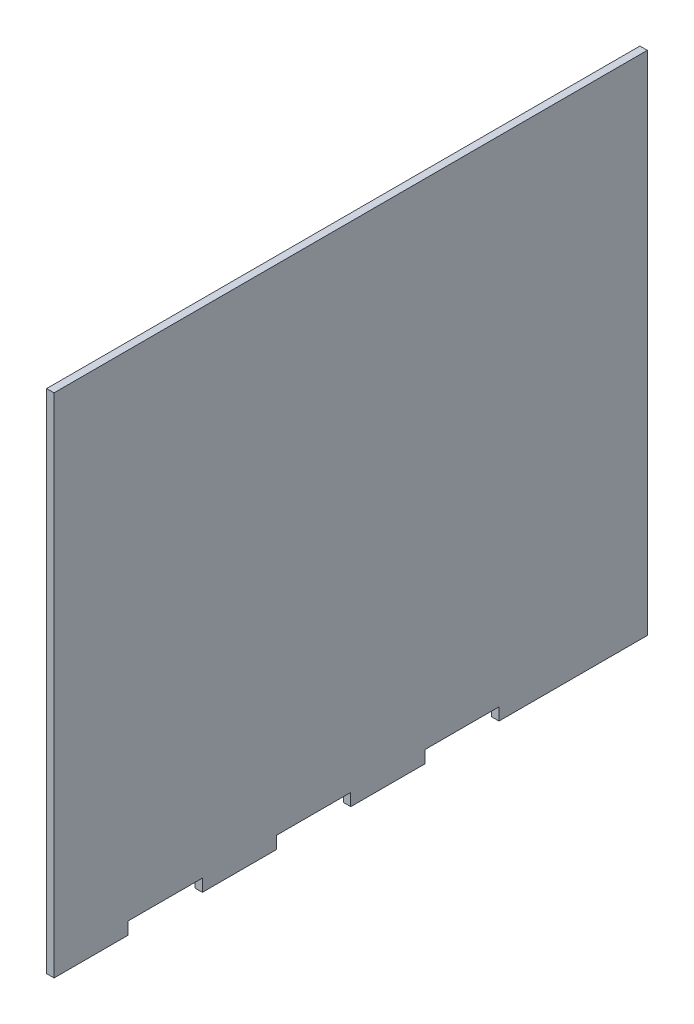
ISO-10303-21;
HEADER;
FILE_DESCRIPTION(('STEP AP214'),'2;1');
FILE_NAME('part.step','',(''),(''),'','','');
FILE_SCHEMA(('AUTOMOTIVE_DESIGN { 1 0 10303 214 1 1 1 1 }'));
ENDSEC;
DATA;
#1=APPLICATION_CONTEXT('core data for automotive mechanical design processes');
#2=APPLICATION_PROTOCOL_DEFINITION('international standard','automotive_design',2000,#1);
#3=PRODUCT_CONTEXT('',#1,'mechanical');
#4=PRODUCT('Part','Part','',(#3));
#5=PRODUCT_RELATED_PRODUCT_CATEGORY('part','',(#4));
#6=PRODUCT_DEFINITION_FORMATION('','',#4);
#7=PRODUCT_DEFINITION_CONTEXT('part definition',#1,'design');
#8=PRODUCT_DEFINITION('design','',#6,#7);
#9=PRODUCT_DEFINITION_SHAPE('','',#8);
#10=(LENGTH_UNIT() NAMED_UNIT(*) SI_UNIT(.MILLI.,.METRE.));
#11=(NAMED_UNIT(*) PLANE_ANGLE_UNIT() SI_UNIT($,.RADIAN.));
#12=(NAMED_UNIT(*) SI_UNIT($,.STERADIAN.) SOLID_ANGLE_UNIT());
#13=UNCERTAINTY_MEASURE_WITH_UNIT(LENGTH_MEASURE(1.E-05),#10,'distance_accuracy_value','');
#14=(GEOMETRIC_REPRESENTATION_CONTEXT(3) GLOBAL_UNCERTAINTY_ASSIGNED_CONTEXT((#13)) GLOBAL_UNIT_ASSIGNED_CONTEXT((#10,
#11,#12)) REPRESENTATION_CONTEXT('',''));
#15=CARTESIAN_POINT('',(0.,0.,0.));
#16=DIRECTION('',(0.,0.,1.));
#17=DIRECTION('',(1.,0.,0.));
#18=AXIS2_PLACEMENT_3D('',#15,#16,#17);
#19=CARTESIAN_POINT('',(3.,-102.5,120.));
#20=DIRECTION('',(0.,1.,0.));
#21=DIRECTION('',(0.,0.,1.));
#22=AXIS2_PLACEMENT_3D('',#19,#20,#21);
#23=PLANE('',#22);
#24=DIRECTION('',(0.,0.,-1.));
#25=VECTOR('',#24,1.);
#26=CARTESIAN_POINT('',(0.,-102.5,120.));
#27=LINE('',#26,#25);
#28=CARTESIAN_POINT('',(0.,-102.5,120.));
#29=VERTEX_POINT('',#28);
#30=CARTESIAN_POINT('',(0.,-102.5,90.));
#31=VERTEX_POINT('',#30);
#32=EDGE_CURVE('E173',#29,#31,#27,.T.);
#33=ORIENTED_EDGE('',*,*,#32,.T.);
#34=DIRECTION('',(1.,0.,0.));
#35=VECTOR('',#34,1.);
#36=CARTESIAN_POINT('',(0.,-102.5,90.));
#37=LINE('',#36,#35);
#38=CARTESIAN_POINT('',(3.,-102.5,90.));
#39=VERTEX_POINT('',#38);
#40=EDGE_CURVE('E205',#31,#39,#37,.T.);
#41=ORIENTED_EDGE('',*,*,#40,.T.);
#42=DIRECTION('',(0.,0.,-1.));
#43=VECTOR('',#42,1.);
#44=CARTESIAN_POINT('',(3.,-102.5,120.));
#45=LINE('',#44,#43);
#46=CARTESIAN_POINT('',(3.,-102.5,120.));
#47=VERTEX_POINT('',#46);
#48=EDGE_CURVE('E188',#47,#39,#45,.T.);
#49=ORIENTED_EDGE('',*,*,#48,.F.);
#50=DIRECTION('',(-1.,0.,0.));
#51=VECTOR('',#50,1.);
#52=CARTESIAN_POINT('',(3.,-102.5,120.));
#53=LINE('',#52,#51);
#54=EDGE_CURVE('E187',#47,#29,#53,.T.);
#55=ORIENTED_EDGE('',*,*,#54,.T.);
#56=EDGE_LOOP('',(#33,#41,#49,#55));
#57=FACE_BOUND('',#56,.T.);
#58=ADVANCED_FACE('F36',(#57),#23,.F.);
#59=CARTESIAN_POINT('',(3.,-102.5,60.));
#60=VERTEX_POINT('',#59);
#61=CARTESIAN_POINT('',(3.,-102.5,30.));
#62=VERTEX_POINT('',#61);
#63=EDGE_CURVE('E166',#60,#62,#45,.T.);
#64=ORIENTED_EDGE('',*,*,#63,.F.);
#65=DIRECTION('',(1.,0.,0.));
#66=VECTOR('',#65,1.);
#67=CARTESIAN_POINT('',(0.,-102.5,60.));
#68=LINE('',#67,#66);
#69=CARTESIAN_POINT('',(0.,-102.5,60.));
#70=VERTEX_POINT('',#69);
#71=EDGE_CURVE('E152',#70,#60,#68,.T.);
#72=ORIENTED_EDGE('',*,*,#71,.F.);
#73=CARTESIAN_POINT('',(0.,-102.5,30.));
#74=VERTEX_POINT('',#73);
#75=EDGE_CURVE('E164',#70,#74,#27,.T.);
#76=ORIENTED_EDGE('',*,*,#75,.T.);
#77=DIRECTION('',(1.,0.,0.));
#78=VECTOR('',#77,1.);
#79=CARTESIAN_POINT('',(0.,-102.5,30.));
#80=LINE('',#79,#78);
#81=EDGE_CURVE('E249',#74,#62,#80,.T.);
#82=ORIENTED_EDGE('',*,*,#81,.T.);
#83=EDGE_LOOP('',(#64,#72,#76,#82));
#84=FACE_BOUND('',#83,.T.);
#85=ADVANCED_FACE('F162',(#84),#23,.F.);
#86=CARTESIAN_POINT('',(3.,-102.5,0.));
#87=VERTEX_POINT('',#86);
#88=CARTESIAN_POINT('',(3.,-102.5,-30.));
#89=VERTEX_POINT('',#88);
#90=EDGE_CURVE('E309',#87,#89,#45,.T.);
#91=ORIENTED_EDGE('',*,*,#90,.F.);
#92=DIRECTION('',(1.,0.,0.));
#93=VECTOR('',#92,1.);
#94=CARTESIAN_POINT('',(0.,-102.5,0.));
#95=LINE('',#94,#93);
#96=CARTESIAN_POINT('',(0.,-102.5,0.));
#97=VERTEX_POINT('',#96);
#98=EDGE_CURVE('E243',#97,#87,#95,.T.);
#99=ORIENTED_EDGE('',*,*,#98,.F.);
#100=CARTESIAN_POINT('',(0.,-102.5,-30.));
#101=VERTEX_POINT('',#100);
#102=EDGE_CURVE('E174',#97,#101,#27,.T.);
#103=ORIENTED_EDGE('',*,*,#102,.T.);
#104=DIRECTION('',(1.,0.,0.));
#105=VECTOR('',#104,1.);
#106=CARTESIAN_POINT('',(0.,-102.5,-30.));
#107=LINE('',#106,#105);
#108=EDGE_CURVE('E223',#101,#89,#107,.T.);
#109=ORIENTED_EDGE('',*,*,#108,.T.);
#110=EDGE_LOOP('',(#91,#99,#103,#109));
#111=FACE_BOUND('',#110,.T.);
#112=ADVANCED_FACE('F308',(#111),#23,.F.);
#113=CARTESIAN_POINT('',(3.,102.5,-120.));
#114=DIRECTION('',(0.,0.,1.));
#115=DIRECTION('',(0.,-1.,0.));
#116=AXIS2_PLACEMENT_3D('',#113,#114,#115);
#117=PLANE('',#116);
#118=DIRECTION('',(0.,1.,0.));
#119=VECTOR('',#118,1.);
#120=CARTESIAN_POINT('',(0.,102.5,-120.));
#121=LINE('',#120,#119);
#122=CARTESIAN_POINT('',(0.,-102.5,-120.));
#123=VERTEX_POINT('',#122);
#124=CARTESIAN_POINT('',(0.,102.5,-120.));
#125=VERTEX_POINT('',#124);
#126=EDGE_CURVE('E203',#123,#125,#121,.T.);
#127=ORIENTED_EDGE('',*,*,#126,.T.);
#128=DIRECTION('',(-1.,0.,0.));
#129=VECTOR('',#128,1.);
#130=CARTESIAN_POINT('',(3.,102.5,-120.));
#131=LINE('',#130,#129);
#132=CARTESIAN_POINT('',(3.,102.5,-120.));
#133=VERTEX_POINT('',#132);
#134=EDGE_CURVE('E11',#133,#125,#131,.T.);
#135=ORIENTED_EDGE('',*,*,#134,.F.);
#136=DIRECTION('',(0.,1.,0.));
#137=VECTOR('',#136,1.);
#138=CARTESIAN_POINT('',(3.,102.5,-120.));
#139=LINE('',#138,#137);
#140=CARTESIAN_POINT('',(3.,-102.5,-120.));
#141=VERTEX_POINT('',#140);
#142=EDGE_CURVE('E177',#141,#133,#139,.T.);
#143=ORIENTED_EDGE('',*,*,#142,.F.);
#144=DIRECTION('',(-1.,0.,0.));
#145=VECTOR('',#144,1.);
#146=CARTESIAN_POINT('',(3.,-102.5,-120.));
#147=LINE('',#146,#145);
#148=EDGE_CURVE('E184',#141,#123,#147,.T.);
#149=ORIENTED_EDGE('',*,*,#148,.T.);
#150=EDGE_LOOP('',(#127,#135,#143,#149));
#151=FACE_BOUND('',#150,.T.);
#152=ADVANCED_FACE('F38',(#151),#117,.F.);
#153=CARTESIAN_POINT('',(3.,102.5,120.));
#154=DIRECTION('',(0.,-1.,0.));
#155=DIRECTION('',(0.,0.,-1.));
#156=AXIS2_PLACEMENT_3D('',#153,#154,#155);
#157=PLANE('',#156);
#158=DIRECTION('',(0.,0.,1.));
#159=VECTOR('',#158,1.);
#160=CARTESIAN_POINT('',(0.,102.5,120.));
#161=LINE('',#160,#159);
#162=CARTESIAN_POINT('',(0.,102.5,120.));
#163=VERTEX_POINT('',#162);
#164=EDGE_CURVE('E201',#125,#163,#161,.T.);
#165=ORIENTED_EDGE('',*,*,#164,.T.);
#166=DIRECTION('',(-1.,0.,0.));
#167=VECTOR('',#166,1.);
#168=CARTESIAN_POINT('',(3.,102.5,120.));
#169=LINE('',#168,#167);
#170=CARTESIAN_POINT('',(3.,102.5,120.));
#171=VERTEX_POINT('',#170);
#172=EDGE_CURVE('E44',#171,#163,#169,.T.);
#173=ORIENTED_EDGE('',*,*,#172,.F.);
#174=DIRECTION('',(0.,0.,1.));
#175=VECTOR('',#174,1.);
#176=CARTESIAN_POINT('',(3.,102.5,120.));
#177=LINE('',#176,#175);
#178=EDGE_CURVE('E212',#133,#171,#177,.T.);
#179=ORIENTED_EDGE('',*,*,#178,.F.);
#180=ORIENTED_EDGE('',*,*,#134,.T.);
#181=EDGE_LOOP('',(#165,#173,#179,#180));
#182=FACE_BOUND('',#181,.T.);
#183=ADVANCED_FACE('F285',(#182),#157,.F.);
#184=CARTESIAN_POINT('',(3.,102.5,120.));
#185=DIRECTION('',(0.,0.,-1.));
#186=DIRECTION('',(0.,1.,0.));
#187=AXIS2_PLACEMENT_3D('',#184,#185,#186);
#188=PLANE('',#187);
#189=DIRECTION('',(0.,-1.,0.));
#190=VECTOR('',#189,1.);
#191=CARTESIAN_POINT('',(0.,102.5,120.));
#192=LINE('',#191,#190);
#193=EDGE_CURVE('E182',#163,#29,#192,.T.);
#194=ORIENTED_EDGE('',*,*,#193,.T.);
#195=ORIENTED_EDGE('',*,*,#54,.F.);
#196=DIRECTION('',(0.,-1.,0.));
#197=VECTOR('',#196,1.);
#198=CARTESIAN_POINT('',(3.,102.5,120.));
#199=LINE('',#198,#197);
#200=EDGE_CURVE('E197',#171,#47,#199,.T.);
#201=ORIENTED_EDGE('',*,*,#200,.F.);
#202=ORIENTED_EDGE('',*,*,#172,.T.);
#203=EDGE_LOOP('',(#194,#195,#201,#202));
#204=FACE_BOUND('',#203,.T.);
#205=ADVANCED_FACE('F195',(#204),#188,.F.);
#206=CARTESIAN_POINT('',(3.,-102.5,-60.));
#207=VERTEX_POINT('',#206);
#208=EDGE_CURVE('E210',#207,#141,#45,.T.);
#209=ORIENTED_EDGE('',*,*,#208,.F.);
#210=DIRECTION('',(1.,0.,0.));
#211=VECTOR('',#210,1.);
#212=CARTESIAN_POINT('',(0.,-102.5,-60.));
#213=LINE('',#212,#211);
#214=CARTESIAN_POINT('',(0.,-102.5,-60.));
#215=VERTEX_POINT('',#214);
#216=EDGE_CURVE('E216',#215,#207,#213,.T.);
#217=ORIENTED_EDGE('',*,*,#216,.F.);
#218=EDGE_CURVE('E178',#215,#123,#27,.T.);
#219=ORIENTED_EDGE('',*,*,#218,.T.);
#220=ORIENTED_EDGE('',*,*,#148,.F.);
#221=EDGE_LOOP('',(#209,#217,#219,#220));
#222=FACE_BOUND('',#221,.T.);
#223=ADVANCED_FACE('F292',(#222),#23,.F.);
#224=CARTESIAN_POINT('',(3.,0.,0.));
#225=DIRECTION('',(1.,0.,0.));
#226=DIRECTION('',(0.,0.,-1.));
#227=AXIS2_PLACEMENT_3D('',#224,#225,#226);
#228=PLANE('',#227);
#229=DIRECTION('',(0.,-1.,0.));
#230=VECTOR('',#229,1.);
#231=CARTESIAN_POINT('',(3.,-102.5,90.));
#232=LINE('',#231,#230);
#233=CARTESIAN_POINT('',(3.,-97.5,90.));
#234=VERTEX_POINT('',#233);
#235=EDGE_CURVE('E157',#234,#39,#232,.T.);
#236=ORIENTED_EDGE('',*,*,#235,.F.);
#237=DIRECTION('',(0.,0.,1.));
#238=VECTOR('',#237,1.);
#239=CARTESIAN_POINT('',(3.,-97.5,90.));
#240=LINE('',#239,#238);
#241=CARTESIAN_POINT('',(3.,-97.5,60.));
#242=VERTEX_POINT('',#241);
#243=EDGE_CURVE('E270',#242,#234,#240,.T.);
#244=ORIENTED_EDGE('',*,*,#243,.F.);
#245=DIRECTION('',(0.,1.,0.));
#246=VECTOR('',#245,1.);
#247=CARTESIAN_POINT('',(3.,-97.5,60.));
#248=LINE('',#247,#246);
#249=EDGE_CURVE('E251',#60,#242,#248,.T.);
#250=ORIENTED_EDGE('',*,*,#249,.F.);
#251=ORIENTED_EDGE('',*,*,#63,.T.);
#252=DIRECTION('',(0.,-1.,0.));
#253=VECTOR('',#252,1.);
#254=CARTESIAN_POINT('',(3.,-102.5,30.));
#255=LINE('',#254,#253);
#256=CARTESIAN_POINT('',(3.,-97.5,30.));
#257=VERTEX_POINT('',#256);
#258=EDGE_CURVE('E252',#257,#62,#255,.T.);
#259=ORIENTED_EDGE('',*,*,#258,.F.);
#260=DIRECTION('',(0.,0.,1.));
#261=VECTOR('',#260,1.);
#262=CARTESIAN_POINT('',(3.,-97.5,30.));
#263=LINE('',#262,#261);
#264=CARTESIAN_POINT('',(3.,-97.5,0.));
#265=VERTEX_POINT('',#264);
#266=EDGE_CURVE('E255',#265,#257,#263,.T.);
#267=ORIENTED_EDGE('',*,*,#266,.F.);
#268=DIRECTION('',(0.,1.,0.));
#269=VECTOR('',#268,1.);
#270=CARTESIAN_POINT('',(3.,-97.5,0.));
#271=LINE('',#270,#269);
#272=EDGE_CURVE('E226',#87,#265,#271,.T.);
#273=ORIENTED_EDGE('',*,*,#272,.F.);
#274=ORIENTED_EDGE('',*,*,#90,.T.);
#275=DIRECTION('',(0.,-1.,0.));
#276=VECTOR('',#275,1.);
#277=CARTESIAN_POINT('',(3.,-102.5,-30.));
#278=LINE('',#277,#276);
#279=CARTESIAN_POINT('',(3.,-97.5,-30.));
#280=VERTEX_POINT('',#279);
#281=EDGE_CURVE('E227',#280,#89,#278,.T.);
#282=ORIENTED_EDGE('',*,*,#281,.F.);
#283=DIRECTION('',(0.,0.,1.));
#284=VECTOR('',#283,1.);
#285=CARTESIAN_POINT('',(3.,-97.5,-30.));
#286=LINE('',#285,#284);
#287=CARTESIAN_POINT('',(3.,-97.5,-60.));
#288=VERTEX_POINT('',#287);
#289=EDGE_CURVE('E230',#288,#280,#286,.T.);
#290=ORIENTED_EDGE('',*,*,#289,.F.);
#291=DIRECTION('',(0.,1.,0.));
#292=VECTOR('',#291,1.);
#293=CARTESIAN_POINT('',(3.,-97.5,-60.));
#294=LINE('',#293,#292);
#295=EDGE_CURVE('E233',#207,#288,#294,.T.);
#296=ORIENTED_EDGE('',*,*,#295,.F.);
#297=ORIENTED_EDGE('',*,*,#208,.T.);
#298=ORIENTED_EDGE('',*,*,#142,.T.);
#299=ORIENTED_EDGE('',*,*,#178,.T.);
#300=ORIENTED_EDGE('',*,*,#200,.T.);
#301=ORIENTED_EDGE('',*,*,#48,.T.);
#302=EDGE_LOOP('',(#236,#244,#250,#251,#259,#267,#273,#274,#282,#290,#296,#297,#298,#299,#300,#301));
#303=FACE_BOUND('',#302,.T.);
#304=ADVANCED_FACE('F281',(#303),#228,.T.);
#305=CARTESIAN_POINT('',(0.,0.,0.));
#306=DIRECTION('',(1.,0.,0.));
#307=DIRECTION('',(0.,0.,-1.));
#308=AXIS2_PLACEMENT_3D('',#305,#306,#307);
#309=PLANE('',#308);
#310=DIRECTION('',(0.,0.,1.));
#311=VECTOR('',#310,1.);
#312=CARTESIAN_POINT('',(0.,-97.5,90.));
#313=LINE('',#312,#311);
#314=CARTESIAN_POINT('',(0.,-97.5,60.));
#315=VERTEX_POINT('',#314);
#316=CARTESIAN_POINT('',(0.,-97.5,90.));
#317=VERTEX_POINT('',#316);
#318=EDGE_CURVE('E51',#315,#317,#313,.T.);
#319=ORIENTED_EDGE('',*,*,#318,.T.);
#320=DIRECTION('',(0.,-1.,0.));
#321=VECTOR('',#320,1.);
#322=CARTESIAN_POINT('',(0.,-102.5,90.));
#323=LINE('',#322,#321);
#324=EDGE_CURVE('E167',#317,#31,#323,.T.);
#325=ORIENTED_EDGE('',*,*,#324,.T.);
#326=ORIENTED_EDGE('',*,*,#32,.F.);
#327=ORIENTED_EDGE('',*,*,#193,.F.);
#328=ORIENTED_EDGE('',*,*,#164,.F.);
#329=ORIENTED_EDGE('',*,*,#126,.F.);
#330=ORIENTED_EDGE('',*,*,#218,.F.);
#331=DIRECTION('',(0.,1.,0.));
#332=VECTOR('',#331,1.);
#333=CARTESIAN_POINT('',(0.,-97.5,-60.));
#334=LINE('',#333,#332);
#335=CARTESIAN_POINT('',(0.,-97.5,-60.));
#336=VERTEX_POINT('',#335);
#337=EDGE_CURVE('E229',#215,#336,#334,.T.);
#338=ORIENTED_EDGE('',*,*,#337,.T.);
#339=DIRECTION('',(0.,0.,1.));
#340=VECTOR('',#339,1.);
#341=CARTESIAN_POINT('',(0.,-97.5,-30.));
#342=LINE('',#341,#340);
#343=CARTESIAN_POINT('',(0.,-97.5,-30.));
#344=VERTEX_POINT('',#343);
#345=EDGE_CURVE('E238',#336,#344,#342,.T.);
#346=ORIENTED_EDGE('',*,*,#345,.T.);
#347=DIRECTION('',(0.,-1.,0.));
#348=VECTOR('',#347,1.);
#349=CARTESIAN_POINT('',(0.,-102.5,-30.));
#350=LINE('',#349,#348);
#351=EDGE_CURVE('E219',#344,#101,#350,.T.);
#352=ORIENTED_EDGE('',*,*,#351,.T.);
#353=ORIENTED_EDGE('',*,*,#102,.F.);
#354=DIRECTION('',(0.,1.,0.));
#355=VECTOR('',#354,1.);
#356=CARTESIAN_POINT('',(0.,-97.5,0.));
#357=LINE('',#356,#355);
#358=CARTESIAN_POINT('',(0.,-97.5,0.));
#359=VERTEX_POINT('',#358);
#360=EDGE_CURVE('E254',#97,#359,#357,.T.);
#361=ORIENTED_EDGE('',*,*,#360,.T.);
#362=DIRECTION('',(0.,0.,1.));
#363=VECTOR('',#362,1.);
#364=CARTESIAN_POINT('',(0.,-97.5,30.));
#365=LINE('',#364,#363);
#366=CARTESIAN_POINT('',(0.,-97.5,30.));
#367=VERTEX_POINT('',#366);
#368=EDGE_CURVE('E59',#359,#367,#365,.T.);
#369=ORIENTED_EDGE('',*,*,#368,.T.);
#370=DIRECTION('',(0.,-1.,0.));
#371=VECTOR('',#370,1.);
#372=CARTESIAN_POINT('',(0.,-102.5,30.));
#373=LINE('',#372,#371);
#374=EDGE_CURVE('E172',#367,#74,#373,.T.);
#375=ORIENTED_EDGE('',*,*,#374,.T.);
#376=ORIENTED_EDGE('',*,*,#75,.F.);
#377=DIRECTION('',(0.,1.,0.));
#378=VECTOR('',#377,1.);
#379=CARTESIAN_POINT('',(0.,-97.5,60.));
#380=LINE('',#379,#378);
#381=EDGE_CURVE('E148',#70,#315,#380,.T.);
#382=ORIENTED_EDGE('',*,*,#381,.T.);
#383=EDGE_LOOP('',(#319,#325,#326,#327,#328,#329,#330,#338,#346,#352,#353,#361,#369,#375,#376,#382));
#384=FACE_BOUND('',#383,.T.);
#385=ADVANCED_FACE('F170',(#384),#309,.F.);
#386=CARTESIAN_POINT('',(0.,-102.5,-30.));
#387=DIRECTION('',(0.,0.,1.));
#388=DIRECTION('',(1.,0.,0.));
#389=AXIS2_PLACEMENT_3D('',#386,#387,#388);
#390=PLANE('',#389);
#391=ORIENTED_EDGE('',*,*,#281,.T.);
#392=ORIENTED_EDGE('',*,*,#108,.F.);
#393=ORIENTED_EDGE('',*,*,#351,.F.);
#394=DIRECTION('',(1.,0.,0.));
#395=VECTOR('',#394,1.);
#396=CARTESIAN_POINT('',(0.,-97.5,-30.));
#397=LINE('',#396,#395);
#398=EDGE_CURVE('E221',#344,#280,#397,.T.);
#399=ORIENTED_EDGE('',*,*,#398,.T.);
#400=EDGE_LOOP('',(#391,#392,#393,#399));
#401=FACE_BOUND('',#400,.T.);
#402=ADVANCED_FACE('F388',(#401),#390,.F.);
#403=CARTESIAN_POINT('',(0.,-97.5,-30.));
#404=DIRECTION('',(0.,1.,0.));
#405=DIRECTION('',(0.,0.,1.));
#406=AXIS2_PLACEMENT_3D('',#403,#404,#405);
#407=PLANE('',#406);
#408=ORIENTED_EDGE('',*,*,#289,.T.);
#409=ORIENTED_EDGE('',*,*,#398,.F.);
#410=ORIENTED_EDGE('',*,*,#345,.F.);
#411=DIRECTION('',(1.,0.,0.));
#412=VECTOR('',#411,1.);
#413=CARTESIAN_POINT('',(0.,-97.5,-60.));
#414=LINE('',#413,#412);
#415=EDGE_CURVE('E218',#336,#288,#414,.T.);
#416=ORIENTED_EDGE('',*,*,#415,.T.);
#417=EDGE_LOOP('',(#408,#409,#410,#416));
#418=FACE_BOUND('',#417,.T.);
#419=ADVANCED_FACE('F301',(#418),#407,.F.);
#420=CARTESIAN_POINT('',(0.,-97.5,-60.));
#421=DIRECTION('',(0.,0.,-1.));
#422=DIRECTION('',(-1.,0.,0.));
#423=AXIS2_PLACEMENT_3D('',#420,#421,#422);
#424=PLANE('',#423);
#425=ORIENTED_EDGE('',*,*,#295,.T.);
#426=ORIENTED_EDGE('',*,*,#415,.F.);
#427=ORIENTED_EDGE('',*,*,#337,.F.);
#428=ORIENTED_EDGE('',*,*,#216,.T.);
#429=EDGE_LOOP('',(#425,#426,#427,#428));
#430=FACE_BOUND('',#429,.T.);
#431=ADVANCED_FACE('F295',(#430),#424,.F.);
#432=CARTESIAN_POINT('',(0.,-102.5,30.));
#433=DIRECTION('',(0.,0.,1.));
#434=DIRECTION('',(1.,0.,0.));
#435=AXIS2_PLACEMENT_3D('',#432,#433,#434);
#436=PLANE('',#435);
#437=ORIENTED_EDGE('',*,*,#258,.T.);
#438=ORIENTED_EDGE('',*,*,#81,.F.);
#439=ORIENTED_EDGE('',*,*,#374,.F.);
#440=DIRECTION('',(1.,0.,0.));
#441=VECTOR('',#440,1.);
#442=CARTESIAN_POINT('',(0.,-97.5,30.));
#443=LINE('',#442,#441);
#444=EDGE_CURVE('E247',#367,#257,#443,.T.);
#445=ORIENTED_EDGE('',*,*,#444,.T.);
#446=EDGE_LOOP('',(#437,#438,#439,#445));
#447=FACE_BOUND('',#446,.T.);
#448=ADVANCED_FACE('F317',(#447),#436,.F.);
#449=CARTESIAN_POINT('',(0.,-97.5,30.));
#450=DIRECTION('',(0.,1.,0.));
#451=DIRECTION('',(0.,0.,1.));
#452=AXIS2_PLACEMENT_3D('',#449,#450,#451);
#453=PLANE('',#452);
#454=ORIENTED_EDGE('',*,*,#266,.T.);
#455=ORIENTED_EDGE('',*,*,#444,.F.);
#456=ORIENTED_EDGE('',*,*,#368,.F.);
#457=DIRECTION('',(1.,0.,0.));
#458=VECTOR('',#457,1.);
#459=CARTESIAN_POINT('',(0.,-97.5,0.));
#460=LINE('',#459,#458);
#461=EDGE_CURVE('E245',#359,#265,#460,.T.);
#462=ORIENTED_EDGE('',*,*,#461,.T.);
#463=EDGE_LOOP('',(#454,#455,#456,#462));
#464=FACE_BOUND('',#463,.T.);
#465=ADVANCED_FACE('F315',(#464),#453,.F.);
#466=CARTESIAN_POINT('',(0.,-97.5,0.));
#467=DIRECTION('',(0.,0.,-1.));
#468=DIRECTION('',(-1.,0.,0.));
#469=AXIS2_PLACEMENT_3D('',#466,#467,#468);
#470=PLANE('',#469);
#471=ORIENTED_EDGE('',*,*,#272,.T.);
#472=ORIENTED_EDGE('',*,*,#461,.F.);
#473=ORIENTED_EDGE('',*,*,#360,.F.);
#474=ORIENTED_EDGE('',*,*,#98,.T.);
#475=EDGE_LOOP('',(#471,#472,#473,#474));
#476=FACE_BOUND('',#475,.T.);
#477=ADVANCED_FACE('F312',(#476),#470,.F.);
#478=CARTESIAN_POINT('',(0.,-102.5,90.));
#479=DIRECTION('',(0.,0.,1.));
#480=DIRECTION('',(1.,0.,0.));
#481=AXIS2_PLACEMENT_3D('',#478,#479,#480);
#482=PLANE('',#481);
#483=ORIENTED_EDGE('',*,*,#235,.T.);
#484=ORIENTED_EDGE('',*,*,#40,.F.);
#485=ORIENTED_EDGE('',*,*,#324,.F.);
#486=DIRECTION('',(1.,0.,0.));
#487=VECTOR('',#486,1.);
#488=CARTESIAN_POINT('',(0.,-97.5,90.));
#489=LINE('',#488,#487);
#490=EDGE_CURVE('E265',#317,#234,#489,.T.);
#491=ORIENTED_EDGE('',*,*,#490,.T.);
#492=EDGE_LOOP('',(#483,#484,#485,#491));
#493=FACE_BOUND('',#492,.T.);
#494=ADVANCED_FACE('F319',(#493),#482,.F.);
#495=CARTESIAN_POINT('',(0.,-97.5,90.));
#496=DIRECTION('',(0.,1.,0.));
#497=DIRECTION('',(0.,0.,1.));
#498=AXIS2_PLACEMENT_3D('',#495,#496,#497);
#499=PLANE('',#498);
#500=ORIENTED_EDGE('',*,*,#243,.T.);
#501=ORIENTED_EDGE('',*,*,#490,.F.);
#502=ORIENTED_EDGE('',*,*,#318,.F.);
#503=DIRECTION('',(1.,0.,0.));
#504=VECTOR('',#503,1.);
#505=CARTESIAN_POINT('',(0.,-97.5,60.));
#506=LINE('',#505,#504);
#507=EDGE_CURVE('E154',#315,#242,#506,.T.);
#508=ORIENTED_EDGE('',*,*,#507,.T.);
#509=EDGE_LOOP('',(#500,#501,#502,#508));
#510=FACE_BOUND('',#509,.T.);
#511=ADVANCED_FACE('F318',(#510),#499,.F.);
#512=CARTESIAN_POINT('',(0.,-97.5,60.));
#513=DIRECTION('',(0.,0.,-1.));
#514=DIRECTION('',(-1.,0.,0.));
#515=AXIS2_PLACEMENT_3D('',#512,#513,#514);
#516=PLANE('',#515);
#517=ORIENTED_EDGE('',*,*,#249,.T.);
#518=ORIENTED_EDGE('',*,*,#507,.F.);
#519=ORIENTED_EDGE('',*,*,#381,.F.);
#520=ORIENTED_EDGE('',*,*,#71,.T.);
#521=EDGE_LOOP('',(#517,#518,#519,#520));
#522=FACE_BOUND('',#521,.T.);
#523=ADVANCED_FACE('F151',(#522),#516,.F.);
#524=CLOSED_SHELL('',(#58,#85,#112,#152,#183,#205,#223,#304,#385,#402,#419,#431,#448,#465,#477,
#494,#511,#523));
#525=MANIFOLD_SOLID_BREP('B2',#524);
#526=ADVANCED_BREP_SHAPE_REPRESENTATION('',(#18,#525),#14);
#527=SHAPE_DEFINITION_REPRESENTATION(#9,#526);
ENDSEC;
END-ISO-10303-21;
